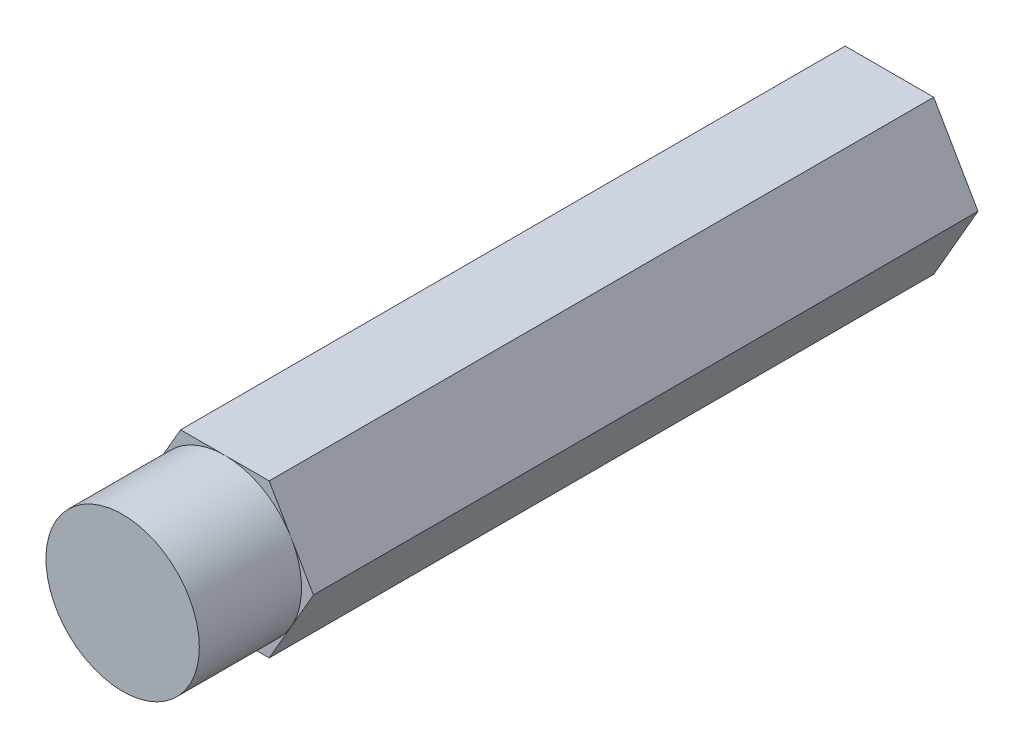
ISO-10303-21;
HEADER;
FILE_DESCRIPTION(('STEP AP214'),'2;1');
FILE_NAME('part.step','',(''),(''),'','','');
FILE_SCHEMA(('AUTOMOTIVE_DESIGN { 1 0 10303 214 1 1 1 1 }'));
ENDSEC;
DATA;
#1=APPLICATION_CONTEXT('core data for automotive mechanical design processes');
#2=APPLICATION_PROTOCOL_DEFINITION('international standard','automotive_design',2000,#1);
#3=PRODUCT_CONTEXT('',#1,'mechanical');
#4=PRODUCT('Part','Part','',(#3));
#5=PRODUCT_RELATED_PRODUCT_CATEGORY('part','',(#4));
#6=PRODUCT_DEFINITION_FORMATION('','',#4);
#7=PRODUCT_DEFINITION_CONTEXT('part definition',#1,'design');
#8=PRODUCT_DEFINITION('design','',#6,#7);
#9=PRODUCT_DEFINITION_SHAPE('','',#8);
#10=(LENGTH_UNIT() NAMED_UNIT(*) SI_UNIT(.MILLI.,.METRE.));
#11=(NAMED_UNIT(*) PLANE_ANGLE_UNIT() SI_UNIT($,.RADIAN.));
#12=(NAMED_UNIT(*) SI_UNIT($,.STERADIAN.) SOLID_ANGLE_UNIT());
#13=UNCERTAINTY_MEASURE_WITH_UNIT(LENGTH_MEASURE(1.E-05),#10,'distance_accuracy_value','');
#14=(GEOMETRIC_REPRESENTATION_CONTEXT(3) GLOBAL_UNCERTAINTY_ASSIGNED_CONTEXT((#13)) GLOBAL_UNIT_ASSIGNED_CONTEXT((#10,
#11,#12)) REPRESENTATION_CONTEXT('',''));
#15=CARTESIAN_POINT('',(0.,0.,0.));
#16=DIRECTION('',(0.,0.,1.));
#17=DIRECTION('',(1.,0.,0.));
#18=AXIS2_PLACEMENT_3D('',#15,#16,#17);
#19=CARTESIAN_POINT('',(0.,0.,41.275));
#20=DIRECTION('',(0.,0.,1.));
#21=DIRECTION('',(1.,0.,0.));
#22=AXIS2_PLACEMENT_3D('',#19,#20,#21);
#23=PLANE('',#22);
#24=CARTESIAN_POINT('',(0.,0.,41.275));
#25=DIRECTION('',(0.,0.,1.));
#26=DIRECTION('',(1.,0.,0.));
#27=AXIS2_PLACEMENT_3D('',#24,#25,#26);
#28=CIRCLE('',#27,4.7625);
#29=CARTESIAN_POINT('',(4.12444598552339,2.38125,41.275));
#30=VERTEX_POINT('',#29);
#31=CARTESIAN_POINT('',(0.,4.7625,41.275));
#32=VERTEX_POINT('',#31);
#33=EDGE_CURVE('E46',#30,#32,#28,.T.);
#34=ORIENTED_EDGE('',*,*,#33,.F.);
#35=DIRECTION('',(-0.5,0.866025403784438,0.));
#36=VECTOR('',#35,1.);
#37=CARTESIAN_POINT('',(5.49926131403119,0.,41.275));
#38=LINE('',#37,#36);
#39=CARTESIAN_POINT('',(2.74963065701559,4.7625,41.275));
#40=VERTEX_POINT('',#39);
#41=EDGE_CURVE('E118',#30,#40,#38,.T.);
#42=ORIENTED_EDGE('',*,*,#41,.T.);
#43=DIRECTION('',(-1.,0.,0.));
#44=VECTOR('',#43,1.);
#45=CARTESIAN_POINT('',(2.74963065701559,4.7625,41.275));
#46=LINE('',#45,#44);
#47=EDGE_CURVE('E130',#40,#32,#46,.T.);
#48=ORIENTED_EDGE('',*,*,#47,.T.);
#49=EDGE_LOOP('',(#34,#42,#48));
#50=FACE_BOUND('',#49,.T.);
#51=ADVANCED_FACE('F35',(#50),#23,.T.);
#52=CARTESIAN_POINT('',(-4.12444598552339,2.38125,41.275));
#53=VERTEX_POINT('',#52);
#54=EDGE_CURVE('E11',#32,#53,#28,.T.);
#55=ORIENTED_EDGE('',*,*,#54,.F.);
#56=CARTESIAN_POINT('',(-2.7496306570156,4.7625,41.275));
#57=VERTEX_POINT('',#56);
#58=EDGE_CURVE('E117',#32,#57,#46,.T.);
#59=ORIENTED_EDGE('',*,*,#58,.T.);
#60=DIRECTION('',(-0.5,-0.866025403784439,0.));
#61=VECTOR('',#60,1.);
#62=CARTESIAN_POINT('',(-2.7496306570156,4.7625,41.275));
#63=LINE('',#62,#61);
#64=EDGE_CURVE('E153',#57,#53,#63,.T.);
#65=ORIENTED_EDGE('',*,*,#64,.T.);
#66=EDGE_LOOP('',(#55,#59,#65));
#67=FACE_BOUND('',#66,.T.);
#68=ADVANCED_FACE('F194',(#67),#23,.T.);
#69=CARTESIAN_POINT('',(-4.12444598552339,-2.38125,41.275));
#70=VERTEX_POINT('',#69);
#71=EDGE_CURVE('E44',#53,#70,#28,.T.);
#72=ORIENTED_EDGE('',*,*,#71,.F.);
#73=CARTESIAN_POINT('',(-5.49926131403119,0.,41.275));
#74=VERTEX_POINT('',#73);
#75=EDGE_CURVE('E152',#53,#74,#63,.T.);
#76=ORIENTED_EDGE('',*,*,#75,.T.);
#77=DIRECTION('',(0.5,-0.866025403784438,0.));
#78=VECTOR('',#77,1.);
#79=CARTESIAN_POINT('',(-5.49926131403119,0.,41.275));
#80=LINE('',#79,#78);
#81=EDGE_CURVE('E142',#74,#70,#80,.T.);
#82=ORIENTED_EDGE('',*,*,#81,.T.);
#83=EDGE_LOOP('',(#72,#76,#82));
#84=FACE_BOUND('',#83,.T.);
#85=ADVANCED_FACE('F203',(#84),#23,.T.);
#86=CARTESIAN_POINT('',(0.,-4.7625,41.275));
#87=VERTEX_POINT('',#86);
#88=EDGE_CURVE('E137',#70,#87,#28,.T.);
#89=ORIENTED_EDGE('',*,*,#88,.F.);
#90=CARTESIAN_POINT('',(-2.74963065701559,-4.7625,41.275));
#91=VERTEX_POINT('',#90);
#92=EDGE_CURVE('E145',#70,#91,#80,.T.);
#93=ORIENTED_EDGE('',*,*,#92,.T.);
#94=DIRECTION('',(1.,0.,0.));
#95=VECTOR('',#94,1.);
#96=CARTESIAN_POINT('',(-2.74963065701559,-4.7625,41.275));
#97=LINE('',#96,#95);
#98=EDGE_CURVE('E146',#91,#87,#97,.T.);
#99=ORIENTED_EDGE('',*,*,#98,.T.);
#100=EDGE_LOOP('',(#89,#93,#99));
#101=FACE_BOUND('',#100,.T.);
#102=ADVANCED_FACE('F198',(#101),#23,.T.);
#103=CARTESIAN_POINT('',(4.12444598552339,-2.38125,41.275));
#104=VERTEX_POINT('',#103);
#105=EDGE_CURVE('E136',#87,#104,#28,.T.);
#106=ORIENTED_EDGE('',*,*,#105,.F.);
#107=CARTESIAN_POINT('',(2.74963065701559,-4.7625,41.275));
#108=VERTEX_POINT('',#107);
#109=EDGE_CURVE('E144',#87,#108,#97,.T.);
#110=ORIENTED_EDGE('',*,*,#109,.T.);
#111=DIRECTION('',(0.5,0.866025403784439,0.));
#112=VECTOR('',#111,1.);
#113=CARTESIAN_POINT('',(2.74963065701559,-4.7625,41.275));
#114=LINE('',#113,#112);
#115=EDGE_CURVE('E128',#108,#104,#114,.T.);
#116=ORIENTED_EDGE('',*,*,#115,.T.);
#117=EDGE_LOOP('',(#106,#110,#116));
#118=FACE_BOUND('',#117,.T.);
#119=ADVANCED_FACE('F213',(#118),#23,.T.);
#120=CARTESIAN_POINT('',(-5.49926131403119,0.,41.275));
#121=DIRECTION('',(0.866025403784438,0.5,0.));
#122=DIRECTION('',(-0.5,0.866025403784439,0.));
#123=AXIS2_PLACEMENT_3D('',#120,#121,#122);
#124=PLANE('',#123);
#125=DIRECTION('',(0.5,-0.866025403784438,0.));
#126=VECTOR('',#125,1.);
#127=CARTESIAN_POINT('',(-5.49926131403119,0.,0.));
#128=LINE('',#127,#126);
#129=CARTESIAN_POINT('',(-5.49926131403119,0.,0.));
#130=VERTEX_POINT('',#129);
#131=CARTESIAN_POINT('',(-2.74963065701559,-4.7625,0.));
#132=VERTEX_POINT('',#131);
#133=EDGE_CURVE('E156',#130,#132,#128,.T.);
#134=ORIENTED_EDGE('',*,*,#133,.T.);
#135=DIRECTION('',(0.,0.,-1.));
#136=VECTOR('',#135,1.);
#137=CARTESIAN_POINT('',(-2.74963065701559,-4.7625,41.275));
#138=LINE('',#137,#136);
#139=EDGE_CURVE('E39',#91,#132,#138,.T.);
#140=ORIENTED_EDGE('',*,*,#139,.F.);
#141=ORIENTED_EDGE('',*,*,#92,.F.);
#142=ORIENTED_EDGE('',*,*,#81,.F.);
#143=DIRECTION('',(0.,0.,-1.));
#144=VECTOR('',#143,1.);
#145=CARTESIAN_POINT('',(-5.49926131403119,0.,41.275));
#146=LINE('',#145,#144);
#147=EDGE_CURVE('E155',#74,#130,#146,.T.);
#148=ORIENTED_EDGE('',*,*,#147,.T.);
#149=EDGE_LOOP('',(#134,#140,#141,#142,#148));
#150=FACE_BOUND('',#149,.T.);
#151=ADVANCED_FACE('F37',(#150),#124,.F.);
#152=CARTESIAN_POINT('',(-2.74963065701559,-4.7625,41.275));
#153=DIRECTION('',(0.,1.,0.));
#154=DIRECTION('',(-1.,0.,0.));
#155=AXIS2_PLACEMENT_3D('',#152,#153,#154);
#156=PLANE('',#155);
#157=DIRECTION('',(1.,0.,0.));
#158=VECTOR('',#157,1.);
#159=CARTESIAN_POINT('',(-2.74963065701559,-4.7625,0.));
#160=LINE('',#159,#158);
#161=CARTESIAN_POINT('',(2.74963065701559,-4.7625,0.));
#162=VERTEX_POINT('',#161);
#163=EDGE_CURVE('E159',#132,#162,#160,.T.);
#164=ORIENTED_EDGE('',*,*,#163,.T.);
#165=DIRECTION('',(0.,0.,-1.));
#166=VECTOR('',#165,1.);
#167=CARTESIAN_POINT('',(2.74963065701559,-4.7625,41.275));
#168=LINE('',#167,#166);
#169=EDGE_CURVE('E139',#108,#162,#168,.T.);
#170=ORIENTED_EDGE('',*,*,#169,.F.);
#171=ORIENTED_EDGE('',*,*,#109,.F.);
#172=ORIENTED_EDGE('',*,*,#98,.F.);
#173=ORIENTED_EDGE('',*,*,#139,.T.);
#174=EDGE_LOOP('',(#164,#170,#171,#172,#173));
#175=FACE_BOUND('',#174,.T.);
#176=ADVANCED_FACE('F276',(#175),#156,.F.);
#177=CARTESIAN_POINT('',(2.74963065701559,-4.7625,41.275));
#178=DIRECTION('',(-0.866025403784439,0.5,0.));
#179=DIRECTION('',(-0.5,-0.866025403784439,0.));
#180=AXIS2_PLACEMENT_3D('',#177,#178,#179);
#181=PLANE('',#180);
#182=DIRECTION('',(0.5,0.866025403784439,0.));
#183=VECTOR('',#182,1.);
#184=CARTESIAN_POINT('',(2.74963065701559,-4.7625,0.));
#185=LINE('',#184,#183);
#186=CARTESIAN_POINT('',(5.49926131403119,0.,0.));
#187=VERTEX_POINT('',#186);
#188=EDGE_CURVE('E161',#162,#187,#185,.T.);
#189=ORIENTED_EDGE('',*,*,#188,.T.);
#190=DIRECTION('',(0.,0.,-1.));
#191=VECTOR('',#190,1.);
#192=CARTESIAN_POINT('',(5.49926131403119,0.,41.275));
#193=LINE('',#192,#191);
#194=CARTESIAN_POINT('',(5.49926131403119,0.,41.275));
#195=VERTEX_POINT('',#194);
#196=EDGE_CURVE('E175',#195,#187,#193,.T.);
#197=ORIENTED_EDGE('',*,*,#196,.F.);
#198=EDGE_CURVE('E113',#104,#195,#114,.T.);
#199=ORIENTED_EDGE('',*,*,#198,.F.);
#200=ORIENTED_EDGE('',*,*,#115,.F.);
#201=ORIENTED_EDGE('',*,*,#169,.T.);
#202=EDGE_LOOP('',(#189,#197,#199,#200,#201));
#203=FACE_BOUND('',#202,.T.);
#204=ADVANCED_FACE('F181',(#203),#181,.F.);
#205=CARTESIAN_POINT('',(5.49926131403119,0.,41.275));
#206=DIRECTION('',(-0.866025403784438,-0.5,0.));
#207=DIRECTION('',(0.5,-0.866025403784438,0.));
#208=AXIS2_PLACEMENT_3D('',#205,#206,#207);
#209=PLANE('',#208);
#210=DIRECTION('',(-0.5,0.866025403784438,0.));
#211=VECTOR('',#210,1.);
#212=CARTESIAN_POINT('',(5.49926131403119,0.,0.));
#213=LINE('',#212,#211);
#214=CARTESIAN_POINT('',(2.74963065701559,4.7625,0.));
#215=VERTEX_POINT('',#214);
#216=EDGE_CURVE('E163',#187,#215,#213,.T.);
#217=ORIENTED_EDGE('',*,*,#216,.T.);
#218=DIRECTION('',(0.,0.,-1.));
#219=VECTOR('',#218,1.);
#220=CARTESIAN_POINT('',(2.74963065701559,4.7625,41.275));
#221=LINE('',#220,#219);
#222=EDGE_CURVE('E124',#40,#215,#221,.T.);
#223=ORIENTED_EDGE('',*,*,#222,.F.);
#224=ORIENTED_EDGE('',*,*,#41,.F.);
#225=EDGE_CURVE('E107',#195,#30,#38,.T.);
#226=ORIENTED_EDGE('',*,*,#225,.F.);
#227=ORIENTED_EDGE('',*,*,#196,.T.);
#228=EDGE_LOOP('',(#217,#223,#224,#226,#227));
#229=FACE_BOUND('',#228,.T.);
#230=ADVANCED_FACE('F122',(#229),#209,.F.);
#231=CARTESIAN_POINT('',(2.74963065701559,4.7625,41.275));
#232=DIRECTION('',(0.,-1.,0.));
#233=DIRECTION('',(1.,0.,0.));
#234=AXIS2_PLACEMENT_3D('',#231,#232,#233);
#235=PLANE('',#234);
#236=DIRECTION('',(-1.,0.,0.));
#237=VECTOR('',#236,1.);
#238=CARTESIAN_POINT('',(2.74963065701559,4.7625,0.));
#239=LINE('',#238,#237);
#240=CARTESIAN_POINT('',(-2.7496306570156,4.7625,0.));
#241=VERTEX_POINT('',#240);
#242=EDGE_CURVE('E165',#215,#241,#239,.T.);
#243=ORIENTED_EDGE('',*,*,#242,.T.);
#244=DIRECTION('',(0.,0.,-1.));
#245=VECTOR('',#244,1.);
#246=CARTESIAN_POINT('',(-2.7496306570156,4.7625,41.275));
#247=LINE('',#246,#245);
#248=EDGE_CURVE('E171',#57,#241,#247,.T.);
#249=ORIENTED_EDGE('',*,*,#248,.F.);
#250=ORIENTED_EDGE('',*,*,#58,.F.);
#251=ORIENTED_EDGE('',*,*,#47,.F.);
#252=ORIENTED_EDGE('',*,*,#222,.T.);
#253=EDGE_LOOP('',(#243,#249,#250,#251,#252));
#254=FACE_BOUND('',#253,.T.);
#255=ADVANCED_FACE('F191',(#254),#235,.F.);
#256=CARTESIAN_POINT('',(-2.7496306570156,4.7625,41.275));
#257=DIRECTION('',(0.866025403784439,-0.5,0.));
#258=DIRECTION('',(0.5,0.866025403784439,0.));
#259=AXIS2_PLACEMENT_3D('',#256,#257,#258);
#260=PLANE('',#259);
#261=DIRECTION('',(-0.5,-0.866025403784439,0.));
#262=VECTOR('',#261,1.);
#263=CARTESIAN_POINT('',(-2.7496306570156,4.7625,0.));
#264=LINE('',#263,#262);
#265=EDGE_CURVE('E167',#241,#130,#264,.T.);
#266=ORIENTED_EDGE('',*,*,#265,.T.);
#267=ORIENTED_EDGE('',*,*,#147,.F.);
#268=ORIENTED_EDGE('',*,*,#75,.F.);
#269=ORIENTED_EDGE('',*,*,#64,.F.);
#270=ORIENTED_EDGE('',*,*,#248,.T.);
#271=EDGE_LOOP('',(#266,#267,#268,#269,#270));
#272=FACE_BOUND('',#271,.T.);
#273=ADVANCED_FACE('F205',(#272),#260,.F.);
#274=EDGE_CURVE('E111',#104,#30,#28,.T.);
#275=ORIENTED_EDGE('',*,*,#274,.F.);
#276=ORIENTED_EDGE('',*,*,#198,.T.);
#277=ORIENTED_EDGE('',*,*,#225,.T.);
#278=EDGE_LOOP('',(#275,#276,#277));
#279=FACE_BOUND('',#278,.T.);
#280=ADVANCED_FACE('F109',(#279),#23,.T.);
#281=CARTESIAN_POINT('',(0.,0.,0.));
#282=DIRECTION('',(0.,0.,1.));
#283=DIRECTION('',(1.,0.,0.));
#284=AXIS2_PLACEMENT_3D('',#281,#282,#283);
#285=PLANE('',#284);
#286=ORIENTED_EDGE('',*,*,#133,.F.);
#287=ORIENTED_EDGE('',*,*,#265,.F.);
#288=ORIENTED_EDGE('',*,*,#242,.F.);
#289=ORIENTED_EDGE('',*,*,#216,.F.);
#290=ORIENTED_EDGE('',*,*,#188,.F.);
#291=ORIENTED_EDGE('',*,*,#163,.F.);
#292=EDGE_LOOP('',(#286,#287,#288,#289,#290,#291));
#293=FACE_BOUND('',#292,.T.);
#294=ADVANCED_FACE('F187',(#293),#285,.F.);
#295=CARTESIAN_POINT('',(0.,0.,47.625));
#296=DIRECTION('',(0.,0.,-1.));
#297=DIRECTION('',(-1.,0.,0.));
#298=AXIS2_PLACEMENT_3D('',#295,#296,#297);
#299=CYLINDRICAL_SURFACE('',#298,4.7625);
#300=CARTESIAN_POINT('',(0.,0.,47.625));
#301=DIRECTION('',(0.,0.,1.));
#302=DIRECTION('',(1.,0.,0.));
#303=AXIS2_PLACEMENT_3D('',#300,#301,#302);
#304=CIRCLE('',#303,4.7625);
#305=CARTESIAN_POINT('',(4.7625,0.,47.625));
#306=VERTEX_POINT('',#305);
#307=EDGE_CURVE('E132',#306,#306,#304,.T.);
#308=ORIENTED_EDGE('',*,*,#307,.F.);
#309=EDGE_LOOP('',(#308));
#310=FACE_BOUND('',#309,.T.);
#311=ORIENTED_EDGE('',*,*,#33,.T.);
#312=ORIENTED_EDGE('',*,*,#54,.T.);
#313=ORIENTED_EDGE('',*,*,#71,.T.);
#314=ORIENTED_EDGE('',*,*,#88,.T.);
#315=ORIENTED_EDGE('',*,*,#105,.T.);
#316=ORIENTED_EDGE('',*,*,#274,.T.);
#317=EDGE_LOOP('',(#311,#312,#313,#314,#315,#316));
#318=FACE_BOUND('',#317,.T.);
#319=ADVANCED_FACE('F134',(#310,#318),#299,.T.);
#320=CARTESIAN_POINT('',(0.,0.,47.625));
#321=DIRECTION('',(0.,0.,1.));
#322=DIRECTION('',(1.,0.,0.));
#323=AXIS2_PLACEMENT_3D('',#320,#321,#322);
#324=PLANE('',#323);
#325=ORIENTED_EDGE('',*,*,#307,.T.);
#326=EDGE_LOOP('',(#325));
#327=FACE_BOUND('',#326,.T.);
#328=ADVANCED_FACE('F226',(#327),#324,.T.);
#329=CLOSED_SHELL('',(#51,#68,#85,#102,#119,#151,#176,#204,#230,#255,#273,#280,#294,#319,#328));
#330=MANIFOLD_SOLID_BREP('B2',#329);
#331=ADVANCED_BREP_SHAPE_REPRESENTATION('',(#18,#330),#14);
#332=SHAPE_DEFINITION_REPRESENTATION(#9,#331);
ENDSEC;
END-ISO-10303-21;
